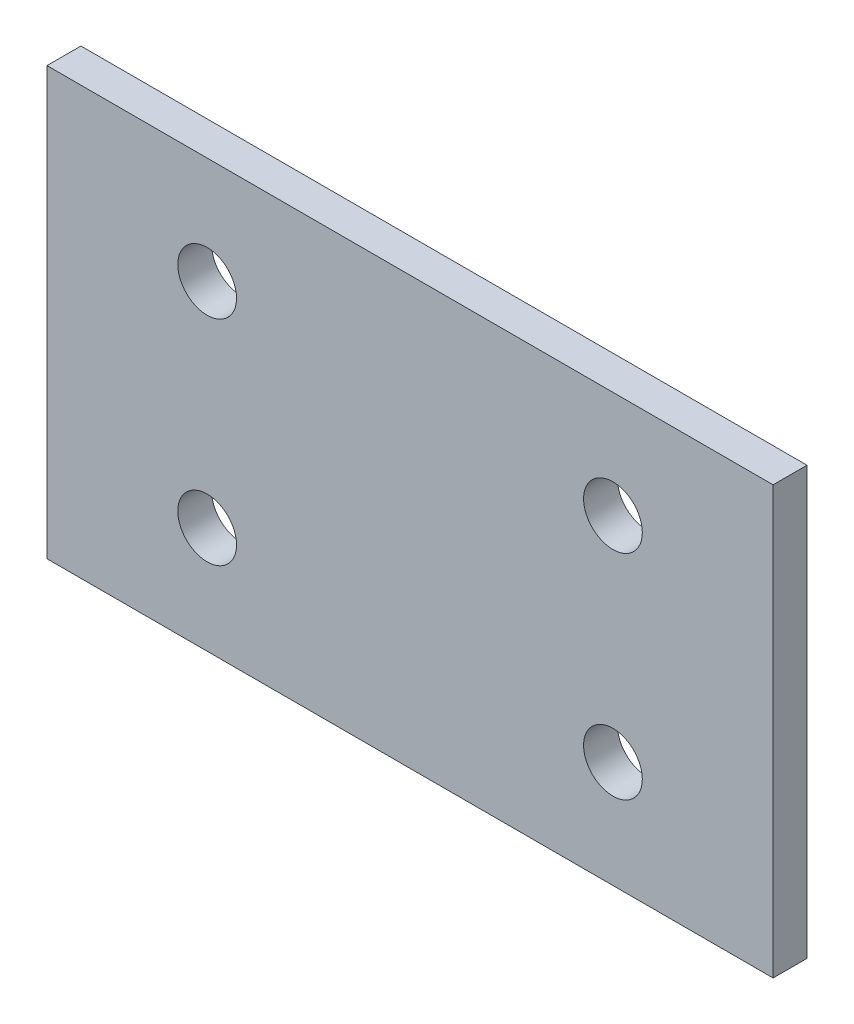
ISO-10303-21;
HEADER;
FILE_DESCRIPTION(('STEP AP214'),'2;1');
FILE_NAME('part.step','',(''),(''),'','','');
FILE_SCHEMA(('AUTOMOTIVE_DESIGN { 1 0 10303 214 1 1 1 1 }'));
ENDSEC;
DATA;
#1=APPLICATION_CONTEXT('core data for automotive mechanical design processes');
#2=APPLICATION_PROTOCOL_DEFINITION('international standard','automotive_design',2000,#1);
#3=PRODUCT_CONTEXT('',#1,'mechanical');
#4=PRODUCT('Part','Part','',(#3));
#5=PRODUCT_RELATED_PRODUCT_CATEGORY('part','',(#4));
#6=PRODUCT_DEFINITION_FORMATION('','',#4);
#7=PRODUCT_DEFINITION_CONTEXT('part definition',#1,'design');
#8=PRODUCT_DEFINITION('design','',#6,#7);
#9=PRODUCT_DEFINITION_SHAPE('','',#8);
#10=(LENGTH_UNIT() NAMED_UNIT(*) SI_UNIT(.MILLI.,.METRE.));
#11=(NAMED_UNIT(*) PLANE_ANGLE_UNIT() SI_UNIT($,.RADIAN.));
#12=(NAMED_UNIT(*) SI_UNIT($,.STERADIAN.) SOLID_ANGLE_UNIT());
#13=UNCERTAINTY_MEASURE_WITH_UNIT(LENGTH_MEASURE(1.E-05),#10,'distance_accuracy_value','');
#14=(GEOMETRIC_REPRESENTATION_CONTEXT(3) GLOBAL_UNCERTAINTY_ASSIGNED_CONTEXT((#13)) GLOBAL_UNIT_ASSIGNED_CONTEXT((#10,
#11,#12)) REPRESENTATION_CONTEXT('',''));
#15=CARTESIAN_POINT('',(0.,0.,0.));
#16=DIRECTION('',(0.,0.,1.));
#17=DIRECTION('',(1.,0.,0.));
#18=AXIS2_PLACEMENT_3D('',#15,#16,#17);
#19=CARTESIAN_POINT('',(0.,0.,3.175));
#20=DIRECTION('',(1.,0.,0.));
#21=DIRECTION('',(0.,0.,-1.));
#22=AXIS2_PLACEMENT_3D('',#19,#20,#21);
#23=PLANE('',#22);
#24=DIRECTION('',(0.,-1.,0.));
#25=VECTOR('',#24,1.);
#26=CARTESIAN_POINT('',(0.,0.,0.));
#27=LINE('',#26,#25);
#28=CARTESIAN_POINT('',(0.,40.,0.));
#29=VERTEX_POINT('',#28);
#30=CARTESIAN_POINT('',(0.,0.,0.));
#31=VERTEX_POINT('',#30);
#32=EDGE_CURVE('E102',#29,#31,#27,.T.);
#33=ORIENTED_EDGE('',*,*,#32,.T.);
#34=DIRECTION('',(0.,0.,-1.));
#35=VECTOR('',#34,1.);
#36=CARTESIAN_POINT('',(0.,0.,3.175));
#37=LINE('',#36,#35);
#38=CARTESIAN_POINT('',(0.,0.,3.175));
#39=VERTEX_POINT('',#38);
#40=EDGE_CURVE('E11',#39,#31,#37,.T.);
#41=ORIENTED_EDGE('',*,*,#40,.F.);
#42=DIRECTION('',(0.,-1.,0.));
#43=VECTOR('',#42,1.);
#44=CARTESIAN_POINT('',(0.,0.,3.175));
#45=LINE('',#44,#43);
#46=CARTESIAN_POINT('',(0.,40.,3.175));
#47=VERTEX_POINT('',#46);
#48=EDGE_CURVE('E90',#47,#39,#45,.T.);
#49=ORIENTED_EDGE('',*,*,#48,.F.);
#50=DIRECTION('',(0.,0.,-1.));
#51=VECTOR('',#50,1.);
#52=CARTESIAN_POINT('',(0.,40.,3.175));
#53=LINE('',#52,#51);
#54=EDGE_CURVE('E98',#47,#29,#53,.T.);
#55=ORIENTED_EDGE('',*,*,#54,.T.);
#56=EDGE_LOOP('',(#33,#41,#49,#55));
#57=FACE_BOUND('',#56,.T.);
#58=ADVANCED_FACE('F39',(#57),#23,.F.);
#59=CARTESIAN_POINT('',(0.,0.,3.175));
#60=DIRECTION('',(0.,1.,0.));
#61=DIRECTION('',(0.,0.,1.));
#62=AXIS2_PLACEMENT_3D('',#59,#60,#61);
#63=PLANE('',#62);
#64=DIRECTION('',(1.,0.,0.));
#65=VECTOR('',#64,1.);
#66=CARTESIAN_POINT('',(0.,0.,0.));
#67=LINE('',#66,#65);
#68=CARTESIAN_POINT('',(68.,0.,0.));
#69=VERTEX_POINT('',#68);
#70=EDGE_CURVE('E94',#31,#69,#67,.T.);
#71=ORIENTED_EDGE('',*,*,#70,.T.);
#72=DIRECTION('',(0.,0.,-1.));
#73=VECTOR('',#72,1.);
#74=CARTESIAN_POINT('',(68.,0.,3.175));
#75=LINE('',#74,#73);
#76=CARTESIAN_POINT('',(68.,0.,3.175));
#77=VERTEX_POINT('',#76);
#78=EDGE_CURVE('E47',#77,#69,#75,.T.);
#79=ORIENTED_EDGE('',*,*,#78,.F.);
#80=DIRECTION('',(1.,0.,0.));
#81=VECTOR('',#80,1.);
#82=CARTESIAN_POINT('',(0.,0.,3.175));
#83=LINE('',#82,#81);
#84=EDGE_CURVE('E85',#39,#77,#83,.T.);
#85=ORIENTED_EDGE('',*,*,#84,.F.);
#86=ORIENTED_EDGE('',*,*,#40,.T.);
#87=EDGE_LOOP('',(#71,#79,#85,#86));
#88=FACE_BOUND('',#87,.T.);
#89=ADVANCED_FACE('F93',(#88),#63,.F.);
#90=CARTESIAN_POINT('',(68.,0.,3.175));
#91=DIRECTION('',(-1.,0.,0.));
#92=DIRECTION('',(0.,0.,1.));
#93=AXIS2_PLACEMENT_3D('',#90,#91,#92);
#94=PLANE('',#93);
#95=DIRECTION('',(0.,1.,0.));
#96=VECTOR('',#95,1.);
#97=CARTESIAN_POINT('',(68.,0.,0.));
#98=LINE('',#97,#96);
#99=CARTESIAN_POINT('',(68.,40.,0.));
#100=VERTEX_POINT('',#99);
#101=EDGE_CURVE('E72',#69,#100,#98,.T.);
#102=ORIENTED_EDGE('',*,*,#101,.T.);
#103=DIRECTION('',(0.,0.,-1.));
#104=VECTOR('',#103,1.);
#105=CARTESIAN_POINT('',(68.,40.,3.175));
#106=LINE('',#105,#104);
#107=CARTESIAN_POINT('',(68.,40.,3.175));
#108=VERTEX_POINT('',#107);
#109=EDGE_CURVE('E95',#108,#100,#106,.T.);
#110=ORIENTED_EDGE('',*,*,#109,.F.);
#111=DIRECTION('',(0.,1.,0.));
#112=VECTOR('',#111,1.);
#113=CARTESIAN_POINT('',(68.,0.,3.175));
#114=LINE('',#113,#112);
#115=EDGE_CURVE('E88',#77,#108,#114,.T.);
#116=ORIENTED_EDGE('',*,*,#115,.F.);
#117=ORIENTED_EDGE('',*,*,#78,.T.);
#118=EDGE_LOOP('',(#102,#110,#116,#117));
#119=FACE_BOUND('',#118,.T.);
#120=ADVANCED_FACE('F96',(#119),#94,.F.);
#121=CARTESIAN_POINT('',(0.,40.,3.175));
#122=DIRECTION('',(0.,-1.,0.));
#123=DIRECTION('',(0.,0.,-1.));
#124=AXIS2_PLACEMENT_3D('',#121,#122,#123);
#125=PLANE('',#124);
#126=DIRECTION('',(-1.,0.,0.));
#127=VECTOR('',#126,1.);
#128=CARTESIAN_POINT('',(0.,40.,0.));
#129=LINE('',#128,#127);
#130=EDGE_CURVE('E78',#100,#29,#129,.T.);
#131=ORIENTED_EDGE('',*,*,#130,.T.);
#132=ORIENTED_EDGE('',*,*,#54,.F.);
#133=DIRECTION('',(-1.,0.,0.));
#134=VECTOR('',#133,1.);
#135=CARTESIAN_POINT('',(0.,40.,3.175));
#136=LINE('',#135,#134);
#137=EDGE_CURVE('E55',#108,#47,#136,.T.);
#138=ORIENTED_EDGE('',*,*,#137,.F.);
#139=ORIENTED_EDGE('',*,*,#109,.T.);
#140=EDGE_LOOP('',(#131,#132,#138,#139));
#141=FACE_BOUND('',#140,.T.);
#142=ADVANCED_FACE('F110',(#141),#125,.F.);
#143=CARTESIAN_POINT('',(0.,0.,3.175));
#144=DIRECTION('',(0.,0.,-1.));
#145=DIRECTION('',(-1.,0.,0.));
#146=AXIS2_PLACEMENT_3D('',#143,#144,#145);
#147=PLANE('',#146);
#148=CARTESIAN_POINT('',(53.,30.,3.175));
#149=DIRECTION('',(0.,0.,1.));
#150=DIRECTION('',(1.,0.,0.));
#151=AXIS2_PLACEMENT_3D('',#148,#149,#150);
#152=CIRCLE('',#151,2.75);
#153=CARTESIAN_POINT('',(55.75,30.,3.175));
#154=VERTEX_POINT('',#153);
#155=EDGE_CURVE('E119',#154,#154,#152,.T.);
#156=ORIENTED_EDGE('',*,*,#155,.F.);
#157=EDGE_LOOP('',(#156));
#158=FACE_BOUND('',#157,.T.);
#159=CARTESIAN_POINT('',(15.,10.,3.175));
#160=DIRECTION('',(0.,0.,1.));
#161=DIRECTION('',(1.,0.,0.));
#162=AXIS2_PLACEMENT_3D('',#159,#160,#161);
#163=CIRCLE('',#162,2.75);
#164=CARTESIAN_POINT('',(17.75,10.,3.175));
#165=VERTEX_POINT('',#164);
#166=EDGE_CURVE('E125',#165,#165,#163,.T.);
#167=ORIENTED_EDGE('',*,*,#166,.F.);
#168=EDGE_LOOP('',(#167));
#169=FACE_BOUND('',#168,.T.);
#170=CARTESIAN_POINT('',(53.,10.,3.175));
#171=DIRECTION('',(0.,0.,1.));
#172=DIRECTION('',(1.,0.,0.));
#173=AXIS2_PLACEMENT_3D('',#170,#171,#172);
#174=CIRCLE('',#173,2.75);
#175=CARTESIAN_POINT('',(55.75,10.,3.175));
#176=VERTEX_POINT('',#175);
#177=EDGE_CURVE('E126',#176,#176,#174,.T.);
#178=ORIENTED_EDGE('',*,*,#177,.F.);
#179=EDGE_LOOP('',(#178));
#180=FACE_BOUND('',#179,.T.);
#181=CARTESIAN_POINT('',(15.,30.,3.175));
#182=DIRECTION('',(0.,0.,1.));
#183=DIRECTION('',(1.,0.,0.));
#184=AXIS2_PLACEMENT_3D('',#181,#182,#183);
#185=CIRCLE('',#184,2.75);
#186=CARTESIAN_POINT('',(17.75,30.,3.175));
#187=VERTEX_POINT('',#186);
#188=EDGE_CURVE('E116',#187,#187,#185,.T.);
#189=ORIENTED_EDGE('',*,*,#188,.F.);
#190=EDGE_LOOP('',(#189));
#191=FACE_BOUND('',#190,.T.);
#192=ORIENTED_EDGE('',*,*,#48,.T.);
#193=ORIENTED_EDGE('',*,*,#84,.T.);
#194=ORIENTED_EDGE('',*,*,#115,.T.);
#195=ORIENTED_EDGE('',*,*,#137,.T.);
#196=EDGE_LOOP('',(#192,#193,#194,#195));
#197=FACE_BOUND('',#196,.T.);
#198=ADVANCED_FACE('F86',(#158,#169,#180,#191,#197),#147,.F.);
#199=CARTESIAN_POINT('',(0.,0.,0.));
#200=DIRECTION('',(0.,0.,-1.));
#201=DIRECTION('',(-1.,0.,0.));
#202=AXIS2_PLACEMENT_3D('',#199,#200,#201);
#203=PLANE('',#202);
#204=CARTESIAN_POINT('',(53.,30.,0.));
#205=DIRECTION('',(0.,0.,1.));
#206=DIRECTION('',(1.,0.,0.));
#207=AXIS2_PLACEMENT_3D('',#204,#205,#206);
#208=CIRCLE('',#207,2.75);
#209=CARTESIAN_POINT('',(55.75,30.,0.));
#210=VERTEX_POINT('',#209);
#211=EDGE_CURVE('E129',#210,#210,#208,.T.);
#212=ORIENTED_EDGE('',*,*,#211,.T.);
#213=EDGE_LOOP('',(#212));
#214=FACE_BOUND('',#213,.T.);
#215=CARTESIAN_POINT('',(15.,10.,0.));
#216=DIRECTION('',(0.,0.,1.));
#217=DIRECTION('',(1.,0.,0.));
#218=AXIS2_PLACEMENT_3D('',#215,#216,#217);
#219=CIRCLE('',#218,2.75);
#220=CARTESIAN_POINT('',(17.75,10.,0.));
#221=VERTEX_POINT('',#220);
#222=EDGE_CURVE('E122',#221,#221,#219,.T.);
#223=ORIENTED_EDGE('',*,*,#222,.T.);
#224=EDGE_LOOP('',(#223));
#225=FACE_BOUND('',#224,.T.);
#226=CARTESIAN_POINT('',(53.,10.,0.));
#227=DIRECTION('',(0.,0.,1.));
#228=DIRECTION('',(1.,0.,0.));
#229=AXIS2_PLACEMENT_3D('',#226,#227,#228);
#230=CIRCLE('',#229,2.75);
#231=CARTESIAN_POINT('',(55.75,10.,0.));
#232=VERTEX_POINT('',#231);
#233=EDGE_CURVE('E134',#232,#232,#230,.T.);
#234=ORIENTED_EDGE('',*,*,#233,.T.);
#235=EDGE_LOOP('',(#234));
#236=FACE_BOUND('',#235,.T.);
#237=CARTESIAN_POINT('',(15.,30.,0.));
#238=DIRECTION('',(0.,0.,1.));
#239=DIRECTION('',(1.,0.,0.));
#240=AXIS2_PLACEMENT_3D('',#237,#238,#239);
#241=CIRCLE('',#240,2.75);
#242=CARTESIAN_POINT('',(17.75,30.,0.));
#243=VERTEX_POINT('',#242);
#244=EDGE_CURVE('E105',#243,#243,#241,.T.);
#245=ORIENTED_EDGE('',*,*,#244,.T.);
#246=EDGE_LOOP('',(#245));
#247=FACE_BOUND('',#246,.T.);
#248=ORIENTED_EDGE('',*,*,#32,.F.);
#249=ORIENTED_EDGE('',*,*,#130,.F.);
#250=ORIENTED_EDGE('',*,*,#101,.F.);
#251=ORIENTED_EDGE('',*,*,#70,.F.);
#252=EDGE_LOOP('',(#248,#249,#250,#251));
#253=FACE_BOUND('',#252,.T.);
#254=ADVANCED_FACE('F113',(#214,#225,#236,#247,#253),#203,.T.);
#255=CARTESIAN_POINT('',(15.,30.,0.));
#256=DIRECTION('',(0.,0.,1.));
#257=DIRECTION('',(1.,0.,0.));
#258=AXIS2_PLACEMENT_3D('',#255,#256,#257);
#259=CYLINDRICAL_SURFACE('',#258,2.75);
#260=ORIENTED_EDGE('',*,*,#244,.F.);
#261=EDGE_LOOP('',(#260));
#262=FACE_BOUND('',#261,.T.);
#263=ORIENTED_EDGE('',*,*,#188,.T.);
#264=EDGE_LOOP('',(#263));
#265=FACE_BOUND('',#264,.T.);
#266=ADVANCED_FACE('F148',(#262,#265),#259,.F.);
#267=CARTESIAN_POINT('',(53.,10.,0.));
#268=DIRECTION('',(0.,0.,1.));
#269=DIRECTION('',(1.,0.,0.));
#270=AXIS2_PLACEMENT_3D('',#267,#268,#269);
#271=CYLINDRICAL_SURFACE('',#270,2.75);
#272=ORIENTED_EDGE('',*,*,#233,.F.);
#273=EDGE_LOOP('',(#272));
#274=FACE_BOUND('',#273,.T.);
#275=ORIENTED_EDGE('',*,*,#177,.T.);
#276=EDGE_LOOP('',(#275));
#277=FACE_BOUND('',#276,.T.);
#278=ADVANCED_FACE('F140',(#274,#277),#271,.F.);
#279=CARTESIAN_POINT('',(15.,10.,0.));
#280=DIRECTION('',(0.,0.,1.));
#281=DIRECTION('',(1.,0.,0.));
#282=AXIS2_PLACEMENT_3D('',#279,#280,#281);
#283=CYLINDRICAL_SURFACE('',#282,2.75);
#284=ORIENTED_EDGE('',*,*,#222,.F.);
#285=EDGE_LOOP('',(#284));
#286=FACE_BOUND('',#285,.T.);
#287=ORIENTED_EDGE('',*,*,#166,.T.);
#288=EDGE_LOOP('',(#287));
#289=FACE_BOUND('',#288,.T.);
#290=ADVANCED_FACE('F156',(#286,#289),#283,.F.);
#291=CARTESIAN_POINT('',(53.,30.,0.));
#292=DIRECTION('',(0.,0.,1.));
#293=DIRECTION('',(1.,0.,0.));
#294=AXIS2_PLACEMENT_3D('',#291,#292,#293);
#295=CYLINDRICAL_SURFACE('',#294,2.75);
#296=ORIENTED_EDGE('',*,*,#211,.F.);
#297=EDGE_LOOP('',(#296));
#298=FACE_BOUND('',#297,.T.);
#299=ORIENTED_EDGE('',*,*,#155,.T.);
#300=EDGE_LOOP('',(#299));
#301=FACE_BOUND('',#300,.T.);
#302=ADVANCED_FACE('F207',(#298,#301),#295,.F.);
#303=CLOSED_SHELL('',(#58,#89,#120,#142,#198,#254,#266,#278,#290,#302));
#304=MANIFOLD_SOLID_BREP('B2',#303);
#305=ADVANCED_BREP_SHAPE_REPRESENTATION('',(#18,#304),#14);
#306=SHAPE_DEFINITION_REPRESENTATION(#9,#305);
ENDSEC;
END-ISO-10303-21;
